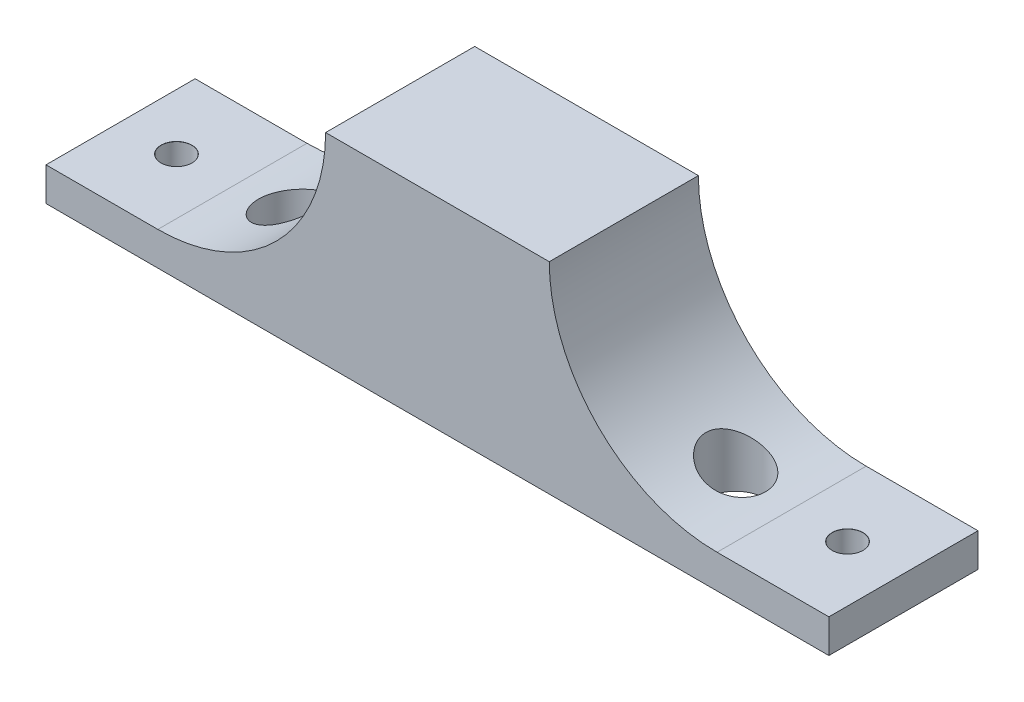
ISO-10303-21;
HEADER;
FILE_DESCRIPTION(('STEP AP214'),'2;1');
FILE_NAME('part.step','',(''),(''),'','','');
FILE_SCHEMA(('AUTOMOTIVE_DESIGN { 1 0 10303 214 1 1 1 1 }'));
ENDSEC;
DATA;
#1=APPLICATION_CONTEXT('core data for automotive mechanical design processes');
#2=APPLICATION_PROTOCOL_DEFINITION('international standard','automotive_design',2000,#1);
#3=PRODUCT_CONTEXT('',#1,'mechanical');
#4=PRODUCT('Part','Part','',(#3));
#5=PRODUCT_RELATED_PRODUCT_CATEGORY('part','',(#4));
#6=PRODUCT_DEFINITION_FORMATION('','',#4);
#7=PRODUCT_DEFINITION_CONTEXT('part definition',#1,'design');
#8=PRODUCT_DEFINITION('design','',#6,#7);
#9=PRODUCT_DEFINITION_SHAPE('','',#8);
#10=(LENGTH_UNIT() NAMED_UNIT(*) SI_UNIT(.MILLI.,.METRE.));
#11=(NAMED_UNIT(*) PLANE_ANGLE_UNIT() SI_UNIT($,.RADIAN.));
#12=(NAMED_UNIT(*) SI_UNIT($,.STERADIAN.) SOLID_ANGLE_UNIT());
#13=UNCERTAINTY_MEASURE_WITH_UNIT(LENGTH_MEASURE(1.E-05),#10,'distance_accuracy_value','');
#14=(GEOMETRIC_REPRESENTATION_CONTEXT(3) GLOBAL_UNCERTAINTY_ASSIGNED_CONTEXT((#13)) GLOBAL_UNIT_ASSIGNED_CONTEXT((#10,
#11,#12)) REPRESENTATION_CONTEXT('',''));
#15=CARTESIAN_POINT('',(0.,0.,0.));
#16=DIRECTION('',(0.,0.,1.));
#17=DIRECTION('',(1.,0.,0.));
#18=AXIS2_PLACEMENT_3D('',#15,#16,#17);
#19=CARTESIAN_POINT('',(-60.,54.,40.));
#20=DIRECTION('',(0.,0.,-1.));
#21=DIRECTION('',(-1.,0.,0.));
#22=AXIS2_PLACEMENT_3D('',#19,#20,#21);
#23=PLANE('',#22);
#24=CARTESIAN_POINT('',(-105.,54.,40.));
#25=DIRECTION('',(0.,0.,-1.));
#26=DIRECTION('',(-1.,0.,0.));
#27=AXIS2_PLACEMENT_3D('',#24,#25,#26);
#28=CIRCLE('',#27,45.0000000000001);
#29=CARTESIAN_POINT('',(-59.9999999999999,54.,40.));
#30=VERTEX_POINT('',#29);
#31=CARTESIAN_POINT('',(-105.,9.,40.));
#32=VERTEX_POINT('',#31);
#33=EDGE_CURVE('E119',#30,#32,#28,.T.);
#34=ORIENTED_EDGE('',*,*,#33,.T.);
#35=DIRECTION('',(-1.,0.,0.));
#36=VECTOR('',#35,1.);
#37=CARTESIAN_POINT('',(-60.,9.,40.));
#38=LINE('',#37,#36);
#39=CARTESIAN_POINT('',(-135.,9.,40.));
#40=VERTEX_POINT('',#39);
#41=EDGE_CURVE('E109',#32,#40,#38,.T.);
#42=ORIENTED_EDGE('',*,*,#41,.T.);
#43=DIRECTION('',(0.,-1.,0.));
#44=VECTOR('',#43,1.);
#45=CARTESIAN_POINT('',(-135.,54.,40.));
#46=LINE('',#45,#44);
#47=CARTESIAN_POINT('',(-135.,0.,40.));
#48=VERTEX_POINT('',#47);
#49=EDGE_CURVE('E116',#40,#48,#46,.T.);
#50=ORIENTED_EDGE('',*,*,#49,.T.);
#51=DIRECTION('',(1.,0.,0.));
#52=VECTOR('',#51,1.);
#53=CARTESIAN_POINT('',(-60.,0.,40.));
#54=LINE('',#53,#52);
#55=CARTESIAN_POINT('',(75.,0.,40.));
#56=VERTEX_POINT('',#55);
#57=EDGE_CURVE('E185',#48,#56,#54,.T.);
#58=ORIENTED_EDGE('',*,*,#57,.T.);
#59=DIRECTION('',(0.,-1.,0.));
#60=VECTOR('',#59,1.);
#61=CARTESIAN_POINT('',(75.,54.,40.));
#62=LINE('',#61,#60);
#63=CARTESIAN_POINT('',(75.,8.99999999999994,40.));
#64=VERTEX_POINT('',#63);
#65=EDGE_CURVE('E182',#64,#56,#62,.T.);
#66=ORIENTED_EDGE('',*,*,#65,.F.);
#67=DIRECTION('',(1.,0.,0.));
#68=VECTOR('',#67,1.);
#69=CARTESIAN_POINT('',(0.,9.,40.));
#70=LINE('',#69,#68);
#71=CARTESIAN_POINT('',(45.,9.,40.));
#72=VERTEX_POINT('',#71);
#73=EDGE_CURVE('E66',#72,#64,#70,.T.);
#74=ORIENTED_EDGE('',*,*,#73,.F.);
#75=CARTESIAN_POINT('',(45.,54.,40.));
#76=DIRECTION('',(0.,0.,1.));
#77=DIRECTION('',(1.,0.,0.));
#78=AXIS2_PLACEMENT_3D('',#75,#76,#77);
#79=CIRCLE('',#78,45.0000000000001);
#80=CARTESIAN_POINT('',(0.,54.,40.));
#81=VERTEX_POINT('',#80);
#82=EDGE_CURVE('E149',#81,#72,#79,.T.);
#83=ORIENTED_EDGE('',*,*,#82,.F.);
#84=DIRECTION('',(1.,0.,0.));
#85=VECTOR('',#84,1.);
#86=CARTESIAN_POINT('',(-60.,54.,40.));
#87=LINE('',#86,#85);
#88=EDGE_CURVE('E186',#30,#81,#87,.T.);
#89=ORIENTED_EDGE('',*,*,#88,.F.);
#90=EDGE_LOOP('',(#34,#42,#50,#58,#66,#74,#83,#89));
#91=FACE_BOUND('',#90,.T.);
#92=ADVANCED_FACE('F44',(#91),#23,.F.);
#93=CARTESIAN_POINT('',(-60.,54.,0.));
#94=DIRECTION('',(0.,0.,1.));
#95=DIRECTION('',(1.,0.,0.));
#96=AXIS2_PLACEMENT_3D('',#93,#94,#95);
#97=PLANE('',#96);
#98=CARTESIAN_POINT('',(-105.,54.,0.));
#99=DIRECTION('',(0.,0.,1.));
#100=DIRECTION('',(1.,0.,0.));
#101=AXIS2_PLACEMENT_3D('',#98,#99,#100);
#102=CIRCLE('',#101,45.0000000000001);
#103=CARTESIAN_POINT('',(-59.9999999999999,54.,0.));
#104=VERTEX_POINT('',#103);
#105=CARTESIAN_POINT('',(-105.,9.,0.));
#106=VERTEX_POINT('',#105);
#107=EDGE_CURVE('E243',#104,#106,#102,.F.);
#108=ORIENTED_EDGE('',*,*,#107,.F.);
#109=DIRECTION('',(-1.,0.,0.));
#110=VECTOR('',#109,1.);
#111=CARTESIAN_POINT('',(-60.,54.,0.));
#112=LINE('',#111,#110);
#113=CARTESIAN_POINT('',(0.,54.,0.));
#114=VERTEX_POINT('',#113);
#115=EDGE_CURVE('E189',#114,#104,#112,.T.);
#116=ORIENTED_EDGE('',*,*,#115,.F.);
#117=CARTESIAN_POINT('',(45.,54.,0.));
#118=DIRECTION('',(0.,0.,1.));
#119=DIRECTION('',(1.,0.,0.));
#120=AXIS2_PLACEMENT_3D('',#117,#118,#119);
#121=CIRCLE('',#120,45.0000000000001);
#122=CARTESIAN_POINT('',(45.,9.,0.));
#123=VERTEX_POINT('',#122);
#124=EDGE_CURVE('E163',#114,#123,#121,.T.);
#125=ORIENTED_EDGE('',*,*,#124,.T.);
#126=DIRECTION('',(1.,0.,0.));
#127=VECTOR('',#126,1.);
#128=CARTESIAN_POINT('',(-60.,9.,0.));
#129=LINE('',#128,#127);
#130=CARTESIAN_POINT('',(75.,9.,0.));
#131=VERTEX_POINT('',#130);
#132=EDGE_CURVE('E167',#123,#131,#129,.T.);
#133=ORIENTED_EDGE('',*,*,#132,.T.);
#134=DIRECTION('',(0.,-1.,0.));
#135=VECTOR('',#134,1.);
#136=CARTESIAN_POINT('',(75.,54.,0.));
#137=LINE('',#136,#135);
#138=CARTESIAN_POINT('',(75.,0.,0.));
#139=VERTEX_POINT('',#138);
#140=EDGE_CURVE('E179',#131,#139,#137,.T.);
#141=ORIENTED_EDGE('',*,*,#140,.T.);
#142=DIRECTION('',(-1.,0.,0.));
#143=VECTOR('',#142,1.);
#144=CARTESIAN_POINT('',(-60.,0.,0.));
#145=LINE('',#144,#143);
#146=CARTESIAN_POINT('',(-135.,0.,0.));
#147=VERTEX_POINT('',#146);
#148=EDGE_CURVE('E190',#139,#147,#145,.T.);
#149=ORIENTED_EDGE('',*,*,#148,.T.);
#150=DIRECTION('',(0.,-1.,0.));
#151=VECTOR('',#150,1.);
#152=CARTESIAN_POINT('',(-135.,54.,0.));
#153=LINE('',#152,#151);
#154=CARTESIAN_POINT('',(-135.,9.,0.));
#155=VERTEX_POINT('',#154);
#156=EDGE_CURVE('E128',#155,#147,#153,.T.);
#157=ORIENTED_EDGE('',*,*,#156,.F.);
#158=DIRECTION('',(-1.,0.,0.));
#159=VECTOR('',#158,1.);
#160=CARTESIAN_POINT('',(-60.,9.,0.));
#161=LINE('',#160,#159);
#162=EDGE_CURVE('E59',#106,#155,#161,.T.);
#163=ORIENTED_EDGE('',*,*,#162,.F.);
#164=EDGE_LOOP('',(#108,#116,#125,#133,#141,#149,#157,#163));
#165=FACE_BOUND('',#164,.T.);
#166=ADVANCED_FACE('F262',(#165),#97,.F.);
#167=CARTESIAN_POINT('',(0.,54.,0.));
#168=DIRECTION('',(0.,1.,0.));
#169=DIRECTION('',(0.,0.,1.));
#170=AXIS2_PLACEMENT_3D('',#167,#168,#169);
#171=PLANE('',#170);
#172=ORIENTED_EDGE('',*,*,#115,.T.);
#173=DIRECTION('',(0.,0.,1.));
#174=VECTOR('',#173,1.);
#175=CARTESIAN_POINT('',(-59.9999999999999,54.,-20.));
#176=LINE('',#175,#174);
#177=EDGE_CURVE('E244',#104,#30,#176,.T.);
#178=ORIENTED_EDGE('',*,*,#177,.T.);
#179=ORIENTED_EDGE('',*,*,#88,.T.);
#180=DIRECTION('',(0.,0.,1.));
#181=VECTOR('',#180,1.);
#182=CARTESIAN_POINT('',(0.,54.,-20.));
#183=LINE('',#182,#181);
#184=EDGE_CURVE('E155',#114,#81,#183,.T.);
#185=ORIENTED_EDGE('',*,*,#184,.F.);
#186=EDGE_LOOP('',(#172,#178,#179,#185));
#187=FACE_BOUND('',#186,.T.);
#188=ADVANCED_FACE('F230',(#187),#171,.T.);
#189=CARTESIAN_POINT('',(-135.,54.,0.));
#190=DIRECTION('',(-1.,0.,0.));
#191=DIRECTION('',(0.,0.,1.));
#192=AXIS2_PLACEMENT_3D('',#189,#190,#191);
#193=PLANE('',#192);
#194=ORIENTED_EDGE('',*,*,#49,.F.);
#195=DIRECTION('',(0.,0.,-1.));
#196=VECTOR('',#195,1.);
#197=CARTESIAN_POINT('',(-135.,9.,0.));
#198=LINE('',#197,#196);
#199=EDGE_CURVE('E11',#40,#155,#198,.T.);
#200=ORIENTED_EDGE('',*,*,#199,.T.);
#201=ORIENTED_EDGE('',*,*,#156,.T.);
#202=DIRECTION('',(0.,0.,-1.));
#203=VECTOR('',#202,1.);
#204=CARTESIAN_POINT('',(-135.,0.,0.));
#205=LINE('',#204,#203);
#206=EDGE_CURVE('E126',#48,#147,#205,.T.);
#207=ORIENTED_EDGE('',*,*,#206,.F.);
#208=EDGE_LOOP('',(#194,#200,#201,#207));
#209=FACE_BOUND('',#208,.T.);
#210=ADVANCED_FACE('F124',(#209),#193,.T.);
#211=CARTESIAN_POINT('',(-90.,54.,20.));
#212=DIRECTION('',(0.,-1.,0.));
#213=DIRECTION('',(0.,0.,-1.));
#214=AXIS2_PLACEMENT_3D('',#211,#212,#213);
#215=CYLINDRICAL_SURFACE('',#214,7.99999999999999);
#216=CARTESIAN_POINT('',(-90.,0.,20.));
#217=DIRECTION('',(0.,-1.,0.));
#218=DIRECTION('',(0.,0.,1.));
#219=AXIS2_PLACEMENT_3D('',#216,#217,#218);
#220=CIRCLE('',#219,7.99999999999999);
#221=CARTESIAN_POINT('',(-90.,0.,28.));
#222=VERTEX_POINT('',#221);
#223=EDGE_CURVE('E134',#222,#222,#220,.T.);
#224=ORIENTED_EDGE('',*,*,#223,.T.);
#225=EDGE_LOOP('',(#224));
#226=FACE_BOUND('',#225,.T.);
#227=CARTESIAN_POINT('',(-90.,11.5735931288071,12.));
#228=CARTESIAN_POINT('',(-89.7577570618509,11.6592383935645,11.9999992374111));
#229=CARTESIAN_POINT('',(-89.5162716392658,11.7469564800232,12.0110068956321));
#230=CARTESIAN_POINT('',(-89.0364699803467,11.9258833616566,12.0545824409712));
#231=CARTESIAN_POINT('',(-88.7981548768108,12.0170933616702,12.0871578340842));
#232=CARTESIAN_POINT('',(-88.3261190197423,12.2023203836002,12.1733949253093));
#233=CARTESIAN_POINT('',(-88.0924044504068,12.2963408059741,12.227083209039));
#234=CARTESIAN_POINT('',(-87.6313760933478,12.4862284483265,12.3549419820975));
#235=CARTESIAN_POINT('',(-87.404064876868,12.5820963848616,12.4291205735999));
#236=CARTESIAN_POINT('',(-86.7349606055954,12.8706555891533,12.6811114326688));
#237=CARTESIAN_POINT('',(-86.3046194712931,13.0648464739197,12.8886342616367));
#238=CARTESIAN_POINT('',(-85.4860967777733,13.4486476778247,13.3779153231439));
#239=CARTESIAN_POINT('',(-85.0979118459494,13.638258362446,13.6596676109449));
#240=CARTESIAN_POINT('',(-84.5528804427681,13.9131210310118,14.1358412864759));
#241=CARTESIAN_POINT('',(-84.3762287179495,14.0037935574841,14.3049673099668));
#242=CARTESIAN_POINT('',(-84.0380122998404,14.1800135367719,14.6600796378772));
#243=CARTESIAN_POINT('',(-83.8764408487224,14.2655632790077,14.8460583158676));
#244=CARTESIAN_POINT('',(-83.5699144699415,14.4300400940248,15.2339615816602));
#245=CARTESIAN_POINT('',(-83.4249593777798,14.5089672323664,15.4358860115692));
#246=CARTESIAN_POINT('',(-83.1532979055126,14.6586012470639,15.8545317681028));
#247=CARTESIAN_POINT('',(-83.0265893749559,14.7293090919161,16.0712513465982));
#248=CARTESIAN_POINT('',(-82.8023715768673,14.8556450310969,16.5002864004388));
#249=CARTESIAN_POINT('',(-82.7033430567268,14.9120245402556,16.7115864483186));
#250=CARTESIAN_POINT('',(-82.5234829777382,15.0151703796477,17.1440396217046));
#251=CARTESIAN_POINT('',(-82.4426483010086,15.061938356891,17.3651910511849));
#252=CARTESIAN_POINT('',(-82.3004492296733,15.1446636014867,17.8153767096004));
#253=CARTESIAN_POINT('',(-82.2390639657149,15.1806324541856,18.044402195004));
#254=CARTESIAN_POINT('',(-82.1366822340487,15.2408430355262,18.5084695517448));
#255=CARTESIAN_POINT('',(-82.0956825209434,15.2650866308222,18.7435104591527));
#256=CARTESIAN_POINT('',(-82.0389432287602,15.2986978509173,19.1850296214009));
#257=CARTESIAN_POINT('',(-82.0205282101904,15.3096392542204,19.39104910725));
#258=CARTESIAN_POINT('',(-81.9997241856645,15.3220028060447,19.8041735879873));
#259=CARTESIAN_POINT('',(-81.9973336908703,15.3234258389175,20.011278480241));
#260=CARTESIAN_POINT('',(-82.0086111058309,15.316720968632,20.4248386529795));
#261=CARTESIAN_POINT('',(-82.022275006199,15.3085954501063,20.6312940827508));
#262=CARTESIAN_POINT('',(-82.0654575870984,15.2829831631618,21.0419500649001));
#263=CARTESIAN_POINT('',(-82.0949761390789,15.2654964706442,21.246150635547));
#264=CARTESIAN_POINT('',(-82.1671546197088,15.2229087456733,21.6382265271553));
#265=CARTESIAN_POINT('',(-82.2088910743859,15.1983442492763,21.82633160034));
#266=CARTESIAN_POINT('',(-82.3054921845725,15.1417647535515,22.1980533406678));
#267=CARTESIAN_POINT('',(-82.3603609983111,15.1097473944382,22.3816685658083));
#268=CARTESIAN_POINT('',(-82.4826215226396,15.0388314718008,22.7432530085171));
#269=CARTESIAN_POINT('',(-82.5500101968044,14.9999345768708,22.9212235828486));
#270=CARTESIAN_POINT('',(-82.6966923092573,14.9158649506796,23.270723854461));
#271=CARTESIAN_POINT('',(-82.7759902957456,14.8706898222374,23.4422510595783));
#272=CARTESIAN_POINT('',(-82.9511919813312,14.7716835688867,23.788711239896));
#273=CARTESIAN_POINT('',(-83.047830710813,14.717484804078,23.9631679486564));
#274=CARTESIAN_POINT('',(-83.2529495563527,14.6035587033419,24.3031116705712));
#275=CARTESIAN_POINT('',(-83.3614339524751,14.5438293703077,24.4685954090847));
#276=CARTESIAN_POINT('',(-83.7034237105825,14.3575598892364,24.9505714319011));
#277=CARTESIAN_POINT('',(-83.9535492883996,14.2238903628393,25.2527522732266));
#278=CARTESIAN_POINT('',(-84.5254437334195,13.926203970454,25.8498992340467));
#279=CARTESIAN_POINT('',(-84.8522714468148,13.7604865811308,26.1391316212824));
#280=CARTESIAN_POINT('',(-85.545850718085,13.4206339931867,26.6594597813635));
#281=CARTESIAN_POINT('',(-85.9126230535141,13.2464944401335,26.8905250891635));
#282=CARTESIAN_POINT('',(-86.5054899346477,12.9755319703403,27.200339497113));
#283=CARTESIAN_POINT('',(-86.7207020862084,12.8791446163192,27.3008648166605));
#284=CARTESIAN_POINT('',(-87.1593987110663,12.6869249808558,27.4824647738556));
#285=CARTESIAN_POINT('',(-87.3828806725773,12.5910925409323,27.5635452624025));
#286=CARTESIAN_POINT('',(-87.8368696705742,12.4008702948366,27.7056791210016));
#287=CARTESIAN_POINT('',(-88.0673805526723,12.3064813223962,27.7667213049136));
#288=CARTESIAN_POINT('',(-88.5337577050948,12.1201016459585,27.8681032503355));
#289=CARTESIAN_POINT('',(-88.7696217579355,12.0281099816452,27.9084514263407));
#290=CARTESIAN_POINT('',(-89.2487854892403,11.8459264913428,27.9683651000232));
#291=CARTESIAN_POINT('',(-89.4921436334599,11.7557823709958,27.9876097312299));
#292=CARTESIAN_POINT('',(-89.9809567020687,11.5795355183981,28.0037121890075));
#293=CARTESIAN_POINT('',(-90.2264107569458,11.4934311981172,28.0005788877473));
#294=CARTESIAN_POINT('',(-90.7175663487039,11.3258929794588,27.9715501899423));
#295=CARTESIAN_POINT('',(-90.9632678738175,11.2444588687737,27.9456558289902));
#296=CARTESIAN_POINT('',(-91.4528437591707,11.0868239553653,27.8708673217652));
#297=CARTESIAN_POINT('',(-91.6967182319091,11.0106228280273,27.8219746036159));
#298=CARTESIAN_POINT('',(-92.1674788251149,10.8678352354506,27.7043951875207));
#299=CARTESIAN_POINT('',(-92.3945752152877,10.8009524002764,27.6369089950712));
#300=CARTESIAN_POINT('',(-92.8432146912883,10.6725606070578,27.4814757366373));
#301=CARTESIAN_POINT('',(-93.0647581257882,10.6110513110011,27.3935299589005));
#302=CARTESIAN_POINT('',(-93.5002549511456,10.493601356089,27.1975838890262));
#303=CARTESIAN_POINT('',(-93.7142103716462,10.4376592007926,27.0895890085521));
#304=CARTESIAN_POINT('',(-94.1326003766211,10.3314047387817,26.8541393695276));
#305=CARTESIAN_POINT('',(-94.3370353967979,10.28109217428,26.7266855026654));
#306=CARTESIAN_POINT('',(-94.7225416542665,10.1889196302258,26.46134963411));
#307=CARTESIAN_POINT('',(-94.904278973834,10.1467340965855,26.3245471125365));
#308=CARTESIAN_POINT('',(-95.2560533826406,10.0672329152389,26.0353738583476));
#309=CARTESIAN_POINT('',(-95.4260909630508,10.0299170630375,25.8830037799476));
#310=CARTESIAN_POINT('',(-95.7529733969524,9.96001316109434,25.5637651980698));
#311=CARTESIAN_POINT('',(-95.9098200688778,9.92742445924039,25.3968986994663));
#312=CARTESIAN_POINT('',(-96.2089857311509,9.86677701263199,25.049849406105));
#313=CARTESIAN_POINT('',(-96.3513048951302,9.83871821373418,24.869666770545));
#314=CARTESIAN_POINT('',(-96.6160411163143,9.78770702915201,24.503058934221));
#315=CARTESIAN_POINT('',(-96.7389359850459,9.76462403329956,24.3169966780487));
#316=CARTESIAN_POINT('',(-96.9689281822666,9.72229043682644,23.9349400625351));
#317=CARTESIAN_POINT('',(-97.0760258262772,9.70303975965932,23.7389459016713));
#318=CARTESIAN_POINT('',(-97.2735614060125,9.66815803422709,23.3384368252235));
#319=CARTESIAN_POINT('',(-97.3640000523898,9.65252683155228,23.1339222735656));
#320=CARTESIAN_POINT('',(-97.5275048153169,9.62468367871782,22.7178366735429));
#321=CARTESIAN_POINT('',(-97.6005709108684,9.61247173269107,22.5062656166491));
#322=CARTESIAN_POINT('',(-97.728246055097,9.59137751405729,22.0792958043269));
#323=CARTESIAN_POINT('',(-97.7829967321115,9.58246963070146,21.8639406485169));
#324=CARTESIAN_POINT('',(-97.874426890289,9.56771043216851,21.4292470950362));
#325=CARTESIAN_POINT('',(-97.9111001620493,9.56186016721033,21.2099073554881));
#326=CARTESIAN_POINT('',(-97.9660609403891,9.55312747552906,20.7689194001448));
#327=CARTESIAN_POINT('',(-97.9843518496063,9.55024449954837,20.5472716192532));
#328=CARTESIAN_POINT('',(-98.0024204183065,9.54739642859867,20.1031993285317));
#329=CARTESIAN_POINT('',(-98.0021976877091,9.5474313951104,19.8807748024346));
#330=CARTESIAN_POINT('',(-97.9832427407797,9.55041947441562,19.4368072081152));
#331=CARTESIAN_POINT('',(-97.9645164741015,9.55337164920573,19.2152638795412));
#332=CARTESIAN_POINT('',(-97.9087062639187,9.56224184679164,18.7745620212332));
#333=CARTESIAN_POINT('',(-97.8716223511918,9.56815986461502,18.5554034875017));
#334=CARTESIAN_POINT('',(-97.779380606198,9.5830568903703,18.1210281849582));
#335=CARTESIAN_POINT('',(-97.7242226764183,9.59203591481694,17.9058114374196));
#336=CARTESIAN_POINT('',(-97.5962591727146,9.61319088951524,17.4808561541774));
#337=CARTESIAN_POINT('',(-97.5234539787406,9.62536677093826,17.2711175006368));
#338=CARTESIAN_POINT('',(-97.360748029962,9.65308764353384,16.8585732600525));
#339=CARTESIAN_POINT('',(-97.2708447261117,9.66863313710827,16.6557687120948));
#340=CARTESIAN_POINT('',(-97.0746893164172,9.70328048166552,16.2586365322476));
#341=CARTESIAN_POINT('',(-96.9684432208246,9.72238102577731,16.0643058175931));
#342=CARTESIAN_POINT('',(-96.7404031343327,9.76435266391911,15.6853892419042));
#343=CARTESIAN_POINT('',(-96.6186073391794,9.78722419559213,15.5008045152297));
#344=CARTESIAN_POINT('',(-96.3604463399598,9.83694547538946,15.1426915653555));
#345=CARTESIAN_POINT('',(-96.2240811459411,9.86379522077027,14.969163334531));
#346=CARTESIAN_POINT('',(-95.9377761562221,9.92168973158692,14.6342397711251));
#347=CARTESIAN_POINT('',(-95.7878273163836,9.95273729885369,14.4728526550572));
#348=CARTESIAN_POINT('',(-95.475637469473,10.0191862245472,14.163417278729));
#349=CARTESIAN_POINT('',(-95.3133964459033,10.0545875888172,14.0153690363714));
#350=CARTESIAN_POINT('',(-94.9778917542574,10.1298859976691,13.733533576725));
#351=CARTESIAN_POINT('',(-94.8046260358277,10.1697838795757,13.5997490246237));
#352=CARTESIAN_POINT('',(-94.4484801882035,10.2541554722688,13.3472809989));
#353=CARTESIAN_POINT('',(-94.2656001132898,10.2986291572225,13.2285974400335));
#354=CARTESIAN_POINT('',(-93.8897377361948,10.3926614302701,13.0058488288798));
#355=CARTESIAN_POINT('',(-93.6966710163055,10.4422675211081,12.9019463102716));
#356=CARTESIAN_POINT('',(-93.3036937816636,10.5461425579154,12.7107366119752));
#357=CARTESIAN_POINT('',(-93.1037830170874,10.6004116742053,12.6234300388417));
#358=CARTESIAN_POINT('',(-92.6987979342993,10.7134596105529,12.4658337495596));
#359=CARTESIAN_POINT('',(-92.4937278355979,10.772234821044,12.3955305967216));
#360=CARTESIAN_POINT('',(-92.0798277080032,10.8941337118559,12.2720661446412));
#361=CARTESIAN_POINT('',(-91.8709984436734,10.9572565151539,12.2189014003555));
#362=CARTESIAN_POINT('',(-91.3861501617149,11.1077421881747,12.1159988406931));
#363=CARTESIAN_POINT('',(-91.1092712212717,11.1965771615757,12.0723741418266));
#364=CARTESIAN_POINT('',(-90.5545984767424,11.3805703953558,12.0143754789649));
#365=CARTESIAN_POINT('',(-90.27680469292,11.4757285165613,12.0000008713905));
#366=CARTESIAN_POINT('',(-90.,11.5735931288071,12.));
#367=B_SPLINE_CURVE_WITH_KNOTS('',3,(#227,#228,#229,#230,#231,#232,#233,#234,#235,#236,#237,
#238,#239,#240,#241,#242,#243,#244,#245,#246,#247,#248,#249,#250,#251,#252,#253,#254,#255,#256,
#257,#258,#259,#260,#261,#262,#263,#264,#265,#266,#267,#268,#269,#270,#271,#272,#273,#274,#275,
#276,#277,#278,#279,#280,#281,#282,#283,#284,#285,#286,#287,#288,#289,#290,#291,#292,#293,#294,
#295,#296,#297,#298,#299,#300,#301,#302,#303,#304,#305,#306,#307,#308,#309,#310,#311,#312,#313,
#314,#315,#316,#317,#318,#319,#320,#321,#322,#323,#324,#325,#326,#327,#328,#329,#330,#331,#332,
#333,#334,#335,#336,#337,#338,#339,#340,#341,#342,#343,#344,#345,#346,#347,#348,#349,#350,#351,
#352,#353,#354,#355,#356,#357,#358,#359,#360,#361,#362,#363,#364,#365,#366),.UNSPECIFIED.,.T.,
.F.,(4,2,2,2,2,2,2,2,2,2,2,2,2,2,2,2,2,2,2,2,2,2,2,2,2,2,2,2,2,2,2,2,2,2,2,2,2,2,2,2,2,2,2,2,2,
2,2,2,2,2,2,2,2,2,2,2,2,2,2,2,2,2,2,2,2,2,2,2,2,4),(0.,0.770534715521514,1.54133773330312,
2.31311447998987,3.08519683665132,4.62490853868461,6.1644969688768,6.94612105324105,
7.72739317453298,8.50865756071098,9.28982979537502,10.0090072871934,10.7280614394697,
11.4463414081217,12.1645069893312,12.7850838803087,13.4056031127033,14.0259674110257,
14.646326679459,15.2283995374096,15.8106569472593,16.3927733269048,16.9751125864351,
17.594458648929,18.2140292380972,19.4526061790289,20.8476482634913,22.2434194890504,
23.0117131598221,23.7797753621552,24.5482655996333,25.3164431091785,26.0961449563752,
26.8755376926959,27.6548949697042,28.4342038575382,29.1717703869845,29.9092904877621,
30.6466118054412,31.3838993462623,32.0770942911185,32.770260116925,33.4633302291237,
34.1563920568348,34.8281177677169,35.499830060253,36.1715136917203,36.843198135058,
37.5095616068262,38.1761538083724,38.842622598707,39.5091054314701,40.1753740320868,
40.8416415156658,41.5079125939467,42.1741693285232,42.84052546895,43.5066371324936,
44.1728261562998,44.8390147206846,45.5056501472421,46.1722864685134,46.8390471340821,
47.5058040356608,48.1794039847256,48.8530285480383,49.5261190378411,50.1990741431959,
51.0795634568935,51.9600333972919),.UNSPECIFIED.);
#368=CARTESIAN_POINT('',(-90.,11.5735931288071,12.));
#369=VERTEX_POINT('',#368);
#370=EDGE_CURVE('E237',#369,#369,#367,.T.);
#371=ORIENTED_EDGE('',*,*,#370,.F.);
#372=EDGE_LOOP('',(#371));
#373=FACE_BOUND('',#372,.T.);
#374=ADVANCED_FACE('F229',(#226,#373),#215,.F.);
#375=CARTESIAN_POINT('',(0.,0.,0.));
#376=DIRECTION('',(0.,1.,0.));
#377=DIRECTION('',(0.,0.,1.));
#378=AXIS2_PLACEMENT_3D('',#375,#376,#377);
#379=PLANE('',#378);
#380=CARTESIAN_POINT('',(-120.,0.,20.));
#381=DIRECTION('',(0.,1.,0.));
#382=DIRECTION('',(0.,0.,1.));
#383=AXIS2_PLACEMENT_3D('',#380,#381,#382);
#384=CIRCLE('',#383,4.125);
#385=CARTESIAN_POINT('',(-120.,0.,24.125));
#386=VERTEX_POINT('',#385);
#387=EDGE_CURVE('E121',#386,#386,#384,.T.);
#388=ORIENTED_EDGE('',*,*,#387,.T.);
#389=EDGE_LOOP('',(#388));
#390=FACE_BOUND('',#389,.T.);
#391=CARTESIAN_POINT('',(60.,0.,20.));
#392=DIRECTION('',(0.,1.,0.));
#393=DIRECTION('',(0.,0.,1.));
#394=AXIS2_PLACEMENT_3D('',#391,#392,#393);
#395=CIRCLE('',#394,4.125);
#396=CARTESIAN_POINT('',(60.,0.,24.125));
#397=VERTEX_POINT('',#396);
#398=EDGE_CURVE('E145',#397,#397,#395,.T.);
#399=ORIENTED_EDGE('',*,*,#398,.T.);
#400=EDGE_LOOP('',(#399));
#401=FACE_BOUND('',#400,.T.);
#402=ORIENTED_EDGE('',*,*,#57,.F.);
#403=ORIENTED_EDGE('',*,*,#206,.T.);
#404=ORIENTED_EDGE('',*,*,#148,.F.);
#405=DIRECTION('',(0.,0.,-1.));
#406=VECTOR('',#405,1.);
#407=CARTESIAN_POINT('',(75.,0.,0.));
#408=LINE('',#407,#406);
#409=EDGE_CURVE('E175',#56,#139,#408,.T.);
#410=ORIENTED_EDGE('',*,*,#409,.F.);
#411=EDGE_LOOP('',(#402,#403,#404,#410));
#412=FACE_BOUND('',#411,.T.);
#413=CARTESIAN_POINT('',(30.,0.,20.));
#414=DIRECTION('',(0.,1.,0.));
#415=DIRECTION('',(0.,0.,1.));
#416=AXIS2_PLACEMENT_3D('',#413,#414,#415);
#417=CIRCLE('',#416,7.99999999999999);
#418=CARTESIAN_POINT('',(30.,0.,28.));
#419=VERTEX_POINT('',#418);
#420=EDGE_CURVE('E171',#419,#419,#417,.T.);
#421=ORIENTED_EDGE('',*,*,#420,.T.);
#422=EDGE_LOOP('',(#421));
#423=FACE_BOUND('',#422,.T.);
#424=ORIENTED_EDGE('',*,*,#223,.F.);
#425=EDGE_LOOP('',(#424));
#426=FACE_BOUND('',#425,.T.);
#427=ADVANCED_FACE('F234',(#390,#401,#412,#423,#426),#379,.F.);
#428=CARTESIAN_POINT('',(75.,54.,0.));
#429=DIRECTION('',(-1.,0.,0.));
#430=DIRECTION('',(0.,0.,1.));
#431=AXIS2_PLACEMENT_3D('',#428,#429,#430);
#432=PLANE('',#431);
#433=ORIENTED_EDGE('',*,*,#140,.F.);
#434=DIRECTION('',(0.,0.,1.));
#435=VECTOR('',#434,1.);
#436=CARTESIAN_POINT('',(75.,9.,0.));
#437=LINE('',#436,#435);
#438=EDGE_CURVE('E52',#131,#64,#437,.T.);
#439=ORIENTED_EDGE('',*,*,#438,.T.);
#440=ORIENTED_EDGE('',*,*,#65,.T.);
#441=ORIENTED_EDGE('',*,*,#409,.T.);
#442=EDGE_LOOP('',(#433,#439,#440,#441));
#443=FACE_BOUND('',#442,.T.);
#444=ADVANCED_FACE('F275',(#443),#432,.F.);
#445=CARTESIAN_POINT('',(30.,54.,20.));
#446=DIRECTION('',(0.,-1.,0.));
#447=DIRECTION('',(0.,0.,-1.));
#448=AXIS2_PLACEMENT_3D('',#445,#446,#447);
#449=CYLINDRICAL_SURFACE('',#448,7.99999999999999);
#450=CARTESIAN_POINT('',(30.,11.5735931288071,12.));
#451=CARTESIAN_POINT('',(30.2236619417778,11.4945124667654,11.9999931502274));
#452=CARTESIAN_POINT('',(30.4478786708649,11.4172361690048,12.0093781625126));
#453=CARTESIAN_POINT('',(30.8960391328714,11.2667105160479,12.0471628347575));
#454=CARTESIAN_POINT('',(31.1199829289017,11.1934599190554,12.0755565951141));
#455=CARTESIAN_POINT('',(31.5661649592869,11.0513450027469,12.1515359494881));
#456=CARTESIAN_POINT('',(31.7884019567833,10.9824836408132,12.1991343281819));
#457=CARTESIAN_POINT('',(32.229255640574,10.8495531519209,12.3135021955709));
#458=CARTESIAN_POINT('',(32.4478737623524,10.7854820875394,12.3802638802694));
#459=CARTESIAN_POINT('',(32.8803258009938,10.6622085065028,12.532977366265));
#460=CARTESIAN_POINT('',(33.0941476173597,10.6030174732221,12.6189727569895));
#461=CARTESIAN_POINT('',(33.5146956496131,10.4898263962758,12.8097132778055));
#462=CARTESIAN_POINT('',(33.7214217812612,10.4358264142241,12.9144586304034));
#463=CARTESIAN_POINT('',(34.1259458640293,10.3330960963257,13.1421263986815));
#464=CARTESIAN_POINT('',(34.3237451571591,10.2843649668421,13.2650460701778));
#465=CARTESIAN_POINT('',(34.708678834655,10.1921481491122,13.5283148103323));
#466=CARTESIAN_POINT('',(34.8958135872255,10.1486622797098,13.6686632767104));
#467=CARTESIAN_POINT('',(35.250783421905,10.0684097722912,13.9601343057795));
#468=CARTESIAN_POINT('',(35.4190832576632,10.0314495204689,14.1106379874793));
#469=CARTESIAN_POINT('',(35.7428280582573,9.96215062850014,14.4258662204148));
#470=CARTESIAN_POINT('',(35.8982731860378,9.92981192976764,14.5905905913371));
#471=CARTESIAN_POINT('',(36.1949737510571,9.86957472155557,14.9330847421192));
#472=CARTESIAN_POINT('',(36.3362305070289,9.8416757992815,15.1108533069286));
#473=CARTESIAN_POINT('',(36.6033741987612,9.79010076940333,15.4781621506374));
#474=CARTESIAN_POINT('',(36.7292612917551,9.76642461859862,15.6677023090822));
#475=CARTESIAN_POINT('',(36.9618412125295,9.72357668039763,16.052579060571));
#476=CARTESIAN_POINT('',(37.0689152807982,9.70431219316109,16.2476750999096));
#477=CARTESIAN_POINT('',(37.2665791251754,9.66937532287615,16.6464400050716));
#478=CARTESIAN_POINT('',(37.3571632781524,9.65370416469717,16.8501117662097));
#479=CARTESIAN_POINT('',(37.521067755904,9.62576775067913,17.2644620555782));
#480=CARTESIAN_POINT('',(37.5943917619463,9.6135017684792,17.4751390787574));
#481=CARTESIAN_POINT('',(37.7232276326059,9.59219830315017,17.902033206127));
#482=CARTESIAN_POINT('',(37.7787392746284,9.58316086036677,18.1182503795142));
#483=CARTESIAN_POINT('',(37.8712969700539,9.56821202447971,18.5536320361216));
#484=CARTESIAN_POINT('',(37.9084294685615,9.56228598891332,18.7727776451122));
#485=CARTESIAN_POINT('',(37.964338677,9.55339975861222,19.2134618434916));
#486=CARTESIAN_POINT('',(37.9831150489156,9.55043961849243,19.4350004768704));
#487=CARTESIAN_POINT('',(38.0021652941327,9.54743648557175,19.878841846985));
#488=CARTESIAN_POINT('',(38.0024432946156,9.54739284206975,20.1011444022128));
#489=CARTESIAN_POINT('',(37.9845012740015,9.55022092741773,20.5450779811699));
#490=CARTESIAN_POINT('',(37.9662733875385,9.55309389588512,20.7667086791748));
#491=CARTESIAN_POINT('',(37.9114450703447,9.56180519262926,21.2076409789086));
#492=CARTESIAN_POINT('',(37.8748434924421,9.56764370606172,21.4269424343368));
#493=CARTESIAN_POINT('',(37.7835671058396,9.58237703992665,21.8615492479805));
#494=CARTESIAN_POINT('',(37.7288999966204,9.59127055838782,22.0768562673978));
#495=CARTESIAN_POINT('',(37.6018959973094,9.6122517293385,22.502084024266));
#496=CARTESIAN_POINT('',(37.5295554037616,9.62434005133845,22.7120036225884));
#497=CARTESIAN_POINT('',(37.3677733935175,9.6518789057844,23.1249129183426));
#498=CARTESIAN_POINT('',(37.2783323598036,9.66732936293289,23.3279027708534));
#499=CARTESIAN_POINT('',(37.0830629821217,9.7017841225424,23.7254881749357));
#500=CARTESIAN_POINT('',(36.9772371286161,9.72078788499857,23.9200849964945));
#501=CARTESIAN_POINT('',(36.7500245329098,9.76255838826882,24.2995431749019));
#502=CARTESIAN_POINT('',(36.6286379819082,9.7853250828476,24.4844046513323));
#503=CARTESIAN_POINT('',(36.3712503606021,9.83483443344651,24.8431300220502));
#504=CARTESIAN_POINT('',(36.2352472758175,9.86157763771254,25.0169923951598));
#505=CARTESIAN_POINT('',(35.9497771525315,9.91922578131158,25.3524424826923));
#506=CARTESIAN_POINT('',(35.8003146913871,9.9501293075302,25.5140343359547));
#507=CARTESIAN_POINT('',(35.488766426992,10.0163457449865,25.8242480605906));
#508=CARTESIAN_POINT('',(35.3266554406589,10.0516675418253,25.9728427400552));
#509=CARTESIAN_POINT('',(34.9913816427809,10.1268069888915,26.255734885522));
#510=CARTESIAN_POINT('',(34.8182188489941,10.1666246318951,26.3900323744962));
#511=CARTESIAN_POINT('',(34.4622243490803,10.2508430564984,26.6435156478446));
#512=CARTESIAN_POINT('',(34.2793927528243,10.2952437860238,26.762701603886));
#513=CARTESIAN_POINT('',(33.9054927423434,10.3886593065668,26.9853036852894));
#514=CARTESIAN_POINT('',(33.7144241131225,10.4376742180594,27.0887193987098));
#515=CARTESIAN_POINT('',(33.32275526153,10.5410130079489,27.2806270000626));
#516=CARTESIAN_POINT('',(33.1220581216634,10.5954024819316,27.3688856989605));
#517=CARTESIAN_POINT('',(32.7152474785412,10.7087833207133,27.5282906552984));
#518=CARTESIAN_POINT('',(32.5091339445987,10.7677747115886,27.5994368157628));
#519=CARTESIAN_POINT('',(32.0930238842162,10.8901752022798,27.7244055004271));
#520=CARTESIAN_POINT('',(31.883027578354,10.9535840517058,27.7782290055375));
#521=CARTESIAN_POINT('',(31.4605481351998,11.0845927692208,27.8685119157092));
#522=CARTESIAN_POINT('',(31.2480641405046,11.1521941189801,27.9049651419677));
#523=CARTESIAN_POINT('',(30.8137391574941,11.2939793075858,27.9616361927006));
#524=CARTESIAN_POINT('',(30.5918580444604,11.3683173287744,27.9811611609608));
#525=CARTESIAN_POINT('',(30.1484536417906,11.5207512945598,28.001702744525));
#526=CARTESIAN_POINT('',(29.9269305142454,11.5988486145909,28.0027125331783));
#527=CARTESIAN_POINT('',(29.4857490675357,11.7582790945604,27.9865042940167));
#528=CARTESIAN_POINT('',(29.2660905075021,11.8396118285776,27.9692886578691));
#529=CARTESIAN_POINT('',(28.8298984533515,12.0049719480327,27.9170180874135));
#530=CARTESIAN_POINT('',(28.6133661985256,12.0890003617175,27.8819562681463));
#531=CARTESIAN_POINT('',(27.9442166610886,12.3546078979502,27.7452544310972));
#532=CARTESIAN_POINT('',(27.4989840121461,12.5399723517665,27.6130371247046));
#533=CARTESIAN_POINT('',(26.638869394428,12.9136380118684,27.2743816394615));
#534=CARTESIAN_POINT('',(26.2239996383961,13.1019403633086,27.0679137904375));
#535=CARTESIAN_POINT('',(25.6228877727594,13.3849778825191,26.7007141386541));
#536=CARTESIAN_POINT('',(25.4218631967996,13.4815631746685,26.5650332150973));
#537=CARTESIAN_POINT('',(25.0322216610912,13.6721592631199,26.2753524543782));
#538=CARTESIAN_POINT('',(24.8435998405011,13.7661710594829,26.1213598611158));
#539=CARTESIAN_POINT('',(24.4800381491519,13.9503712805489,25.795657144168));
#540=CARTESIAN_POINT('',(24.305107642554,14.0405570694805,25.6239350774121));
#541=CARTESIAN_POINT('',(23.9706320856854,14.2155647655392,25.2637515964637));
#542=CARTESIAN_POINT('',(23.8110791603281,14.3003894104431,25.0752988463244));
#543=CARTESIAN_POINT('',(23.5133877987113,14.4607381505061,24.6884564591933));
#544=CARTESIAN_POINT('',(23.3747496425275,14.5364652337966,24.4905361228755));
#545=CARTESIAN_POINT('',(23.1149127131756,14.6799672023909,24.0809734738163));
#546=CARTESIAN_POINT('',(22.9937046179697,14.7477463348529,23.8693385844874));
#547=CARTESIAN_POINT('',(22.7702694430537,14.873850969546,23.4337816735069));
#548=CARTESIAN_POINT('',(22.6680282770722,14.9321834834244,23.209868931737));
#549=CARTESIAN_POINT('',(22.4839440818605,15.0379862161581,22.7513453053848));
#550=CARTESIAN_POINT('',(22.4020974536497,15.0854583513999,22.5167363170027));
#551=CARTESIAN_POINT('',(22.2689352672906,15.1631118927787,22.0684248112302));
#552=CARTESIAN_POINT('',(22.2150991577316,15.1947037349362,21.8557126030078));
#553=CARTESIAN_POINT('',(22.124938186456,15.2477833452568,21.4253801454448));
#554=CARTESIAN_POINT('',(22.0886108437952,15.269272544926,21.2077605960383));
#555=CARTESIAN_POINT('',(22.034048591505,15.3016010057475,20.7696257116611));
#556=CARTESIAN_POINT('',(22.015801719663,15.3124473082962,20.5491123892373));
#557=CARTESIAN_POINT('',(21.9976594716821,15.3232311447396,20.1070712141117));
#558=CARTESIAN_POINT('',(21.9977626573109,15.3231695335697,19.8855434422808));
#559=CARTESIAN_POINT('',(22.015275621454,15.3127602668336,19.4681917983308));
#560=CARTESIAN_POINT('',(22.0307555263267,15.3035596207933,19.2722545345609));
#561=CARTESIAN_POINT('',(22.0759908732234,15.2767447327879,18.8826194556396));
#562=CARTESIAN_POINT('',(22.1057460129734,15.2591306689745,18.6889215931585));
#563=CARTESIAN_POINT('',(22.1791609455821,15.2158393844827,18.305109228922));
#564=CARTESIAN_POINT('',(22.2228204413122,15.1901623361061,18.1149946506856));
#565=CARTESIAN_POINT('',(22.3235319943204,15.131231065316,17.7395527857338));
#566=CARTESIAN_POINT('',(22.3805845715023,15.0979765487554,17.5542256851728));
#567=CARTESIAN_POINT('',(22.5079783027605,15.0241816688856,17.1879734225342));
#568=CARTESIAN_POINT('',(22.578421823543,14.9835853056503,17.0070951640615));
#569=CARTESIAN_POINT('',(22.7315958176644,14.8959597752019,16.6522094224096));
#570=CARTESIAN_POINT('',(22.8143303515442,14.84892848251,16.4782042340039));
#571=CARTESIAN_POINT('',(23.0798658077687,14.6992496062661,15.967800046733));
#572=CARTESIAN_POINT('',(23.2800785471129,14.5879700170565,15.6427853967163));
#573=CARTESIAN_POINT('',(23.7445971014614,14.3353444618224,14.9954483805023));
#574=CARTESIAN_POINT('',(24.0134903776381,14.1920490925944,14.6772101670341));
#575=CARTESIAN_POINT('',(24.5933607989423,13.8916995528918,14.0890834094492));
#576=CARTESIAN_POINT('',(24.9043663127501,13.7346361330138,13.8192277452523));
#577=CARTESIAN_POINT('',(25.6019910296388,13.3935260086335,13.3015920615014));
#578=CARTESIAN_POINT('',(25.9932054821817,13.2085369837638,13.0606131122922));
#579=CARTESIAN_POINT('',(26.8105005721947,12.8375996730248,12.6490631145166));
#580=CARTESIAN_POINT('',(27.2365711699059,12.6516516777293,12.4784718768498));
#581=CARTESIAN_POINT('',(28.0488739867339,12.3127868525125,12.2317434389562));
#582=CARTESIAN_POINT('',(28.4316933272413,12.1590483771429,12.145375771941));
#583=CARTESIAN_POINT('',(29.2090954518418,11.8595164762411,12.0295137235595));
#584=CARTESIAN_POINT('',(29.6036767393381,11.7137220465234,12.0000121376225));
#585=CARTESIAN_POINT('',(30.,11.5735931288071,12.));
#586=B_SPLINE_CURVE_WITH_KNOTS('',3,(#450,#451,#452,#453,#454,#455,#456,#457,#458,#459,#460,
#461,#462,#463,#464,#465,#466,#467,#468,#469,#470,#471,#472,#473,#474,#475,#476,#477,#478,#479,
#480,#481,#482,#483,#484,#485,#486,#487,#488,#489,#490,#491,#492,#493,#494,#495,#496,#497,#498,
#499,#500,#501,#502,#503,#504,#505,#506,#507,#508,#509,#510,#511,#512,#513,#514,#515,#516,#517,
#518,#519,#520,#521,#522,#523,#524,#525,#526,#527,#528,#529,#530,#531,#532,#533,#534,#535,#536,
#537,#538,#539,#540,#541,#542,#543,#544,#545,#546,#547,#548,#549,#550,#551,#552,#553,#554,#555,
#556,#557,#558,#559,#560,#561,#562,#563,#564,#565,#566,#567,#568,#569,#570,#571,#572,#573,#574,
#575,#576,#577,#578,#579,#580,#581,#582,#583,#584,#585),.UNSPECIFIED.,.T.,.F.,(4,2,2,2,2,2,2,2,
2,2,2,2,2,2,2,2,2,2,2,2,2,2,2,2,2,2,2,2,2,2,2,2,2,2,2,2,2,2,2,2,2,2,2,2,2,2,2,2,2,2,2,2,2,2,2,2,
2,2,2,2,2,2,2,2,2,2,2,4),(0.,0.711356454780661,1.42249223346741,2.13410220440505,
2.84542279197031,3.55837208390453,4.27132983699078,4.98418004860459,5.69700563338473,
6.38251816568146,7.06802200718591,7.75346207571646,8.43889513152414,9.10823617983749,
9.77780505048439,10.447230984916,11.1166652845924,11.782920292314,12.4491875684352,
13.1153061928155,13.7817080492778,14.448151518085,15.1143113160123,15.7806108267806,
16.4468954168126,17.1130788320569,17.7792540624867,18.4455212245573,19.1115626475314,
19.7789657594681,20.4463677990442,21.1137622562526,21.7811741437915,22.4580788963746,
23.1349874848335,23.8118577359997,24.4889685780975,25.192636810147,25.896564483412,
26.6003997938348,27.3045068460923,28.7977276748943,30.2915458520524,31.0739048191525,
31.8559553166502,32.6385361057003,33.4207139699958,34.179368120746,34.9376150028642,
35.6952964793222,36.4528441545114,37.1169586844876,37.7809790835712,38.4445598664809,
39.1080886395907,39.6976758536824,40.2872505839851,40.876812716238,41.4663977383946,
42.0606856006018,42.6551702341191,43.8434115466437,45.1600222843529,46.4775244035892,
47.9571257426378,49.43630239647,50.6969676337285,51.9574731422233),.UNSPECIFIED.);
#587=CARTESIAN_POINT('',(30.,11.5735931288071,12.));
#588=VERTEX_POINT('',#587);
#589=EDGE_CURVE('E159',#588,#588,#586,.T.);
#590=ORIENTED_EDGE('',*,*,#589,.F.);
#591=EDGE_LOOP('',(#590));
#592=FACE_BOUND('',#591,.T.);
#593=ORIENTED_EDGE('',*,*,#420,.F.);
#594=EDGE_LOOP('',(#593));
#595=FACE_BOUND('',#594,.T.);
#596=ADVANCED_FACE('F207',(#592,#595),#449,.F.);
#597=CARTESIAN_POINT('',(0.,9.,-20.));
#598=DIRECTION('',(0.,-1.,0.));
#599=DIRECTION('',(0.,0.,-1.));
#600=AXIS2_PLACEMENT_3D('',#597,#598,#599);
#601=PLANE('',#600);
#602=CARTESIAN_POINT('',(60.,9.,20.));
#603=DIRECTION('',(0.,1.,0.));
#604=DIRECTION('',(0.,0.,1.));
#605=AXIS2_PLACEMENT_3D('',#602,#603,#604);
#606=CIRCLE('',#605,4.15);
#607=CARTESIAN_POINT('',(60.,9.,24.15));
#608=VERTEX_POINT('',#607);
#609=EDGE_CURVE('E132',#608,#608,#606,.T.);
#610=ORIENTED_EDGE('',*,*,#609,.F.);
#611=EDGE_LOOP('',(#610));
#612=FACE_BOUND('',#611,.T.);
#613=DIRECTION('',(0.,0.,1.));
#614=VECTOR('',#613,1.);
#615=CARTESIAN_POINT('',(45.,9.,-20.));
#616=LINE('',#615,#614);
#617=EDGE_CURVE('E156',#123,#72,#616,.T.);
#618=ORIENTED_EDGE('',*,*,#617,.T.);
#619=ORIENTED_EDGE('',*,*,#73,.T.);
#620=ORIENTED_EDGE('',*,*,#438,.F.);
#621=ORIENTED_EDGE('',*,*,#132,.F.);
#622=EDGE_LOOP('',(#618,#619,#620,#621));
#623=FACE_BOUND('',#622,.T.);
#624=ADVANCED_FACE('F215',(#612,#623),#601,.F.);
#625=CARTESIAN_POINT('',(45.,54.,-20.));
#626=DIRECTION('',(0.,0.,1.));
#627=DIRECTION('',(1.,0.,0.));
#628=AXIS2_PLACEMENT_3D('',#625,#626,#627);
#629=CYLINDRICAL_SURFACE('',#628,45.0000000000001);
#630=ORIENTED_EDGE('',*,*,#589,.T.);
#631=EDGE_LOOP('',(#630));
#632=FACE_BOUND('',#631,.T.);
#633=ORIENTED_EDGE('',*,*,#184,.T.);
#634=ORIENTED_EDGE('',*,*,#82,.T.);
#635=ORIENTED_EDGE('',*,*,#617,.F.);
#636=ORIENTED_EDGE('',*,*,#124,.F.);
#637=EDGE_LOOP('',(#633,#634,#635,#636));
#638=FACE_BOUND('',#637,.T.);
#639=ADVANCED_FACE('F210',(#632,#638),#629,.F.);
#640=CARTESIAN_POINT('',(60.,9.,20.));
#641=DIRECTION('',(0.,1.,0.));
#642=DIRECTION('',(0.,0.,1.));
#643=AXIS2_PLACEMENT_3D('',#640,#641,#642);
#644=CYLINDRICAL_SURFACE('',#643,4.125);
#645=ORIENTED_EDGE('',*,*,#398,.F.);
#646=EDGE_LOOP('',(#645));
#647=FACE_BOUND('',#646,.T.);
#648=CARTESIAN_POINT('',(60.,8.975,20.));
#649=DIRECTION('',(0.,1.,0.));
#650=DIRECTION('',(0.,0.,1.));
#651=AXIS2_PLACEMENT_3D('',#648,#649,#650);
#652=CIRCLE('',#651,4.125);
#653=CARTESIAN_POINT('',(60.,8.975,24.125));
#654=VERTEX_POINT('',#653);
#655=EDGE_CURVE('E141',#654,#654,#652,.T.);
#656=ORIENTED_EDGE('',*,*,#655,.T.);
#657=EDGE_LOOP('',(#656));
#658=FACE_BOUND('',#657,.T.);
#659=ADVANCED_FACE('F214',(#647,#658),#644,.F.);
#660=CARTESIAN_POINT('',(60.,9.,20.));
#661=DIRECTION('',(0.,1.,0.));
#662=DIRECTION('',(0.,0.,1.));
#663=AXIS2_PLACEMENT_3D('',#660,#661,#662);
#664=CONICAL_SURFACE('',#663,4.15,0.785398163397414);
#665=ORIENTED_EDGE('',*,*,#655,.F.);
#666=EDGE_LOOP('',(#665));
#667=FACE_BOUND('',#666,.T.);
#668=ORIENTED_EDGE('',*,*,#609,.T.);
#669=EDGE_LOOP('',(#668));
#670=FACE_BOUND('',#669,.T.);
#671=ADVANCED_FACE('F222',(#667,#670),#664,.F.);
#672=CARTESIAN_POINT('',(-60.,9.,-20.));
#673=DIRECTION('',(0.,1.,0.));
#674=DIRECTION('',(0.,0.,1.));
#675=AXIS2_PLACEMENT_3D('',#672,#673,#674);
#676=PLANE('',#675);
#677=CARTESIAN_POINT('',(-120.,9.,20.));
#678=DIRECTION('',(0.,1.,0.));
#679=DIRECTION('',(0.,0.,1.));
#680=AXIS2_PLACEMENT_3D('',#677,#678,#679);
#681=CIRCLE('',#680,4.15);
#682=CARTESIAN_POINT('',(-120.,9.,24.15));
#683=VERTEX_POINT('',#682);
#684=EDGE_CURVE('E321',#683,#683,#681,.T.);
#685=ORIENTED_EDGE('',*,*,#684,.F.);
#686=EDGE_LOOP('',(#685));
#687=FACE_BOUND('',#686,.T.);
#688=ORIENTED_EDGE('',*,*,#162,.T.);
#689=ORIENTED_EDGE('',*,*,#199,.F.);
#690=ORIENTED_EDGE('',*,*,#41,.F.);
#691=DIRECTION('',(0.,0.,1.));
#692=VECTOR('',#691,1.);
#693=CARTESIAN_POINT('',(-105.,9.,-20.));
#694=LINE('',#693,#692);
#695=EDGE_CURVE('E301',#106,#32,#694,.T.);
#696=ORIENTED_EDGE('',*,*,#695,.F.);
#697=EDGE_LOOP('',(#688,#689,#690,#696));
#698=FACE_BOUND('',#697,.T.);
#699=ADVANCED_FACE('F108',(#687,#698),#676,.T.);
#700=CARTESIAN_POINT('',(-105.,54.,-20.));
#701=DIRECTION('',(0.,0.,1.));
#702=DIRECTION('',(1.,0.,0.));
#703=AXIS2_PLACEMENT_3D('',#700,#701,#702);
#704=CYLINDRICAL_SURFACE('',#703,45.0000000000001);
#705=ORIENTED_EDGE('',*,*,#370,.T.);
#706=EDGE_LOOP('',(#705));
#707=FACE_BOUND('',#706,.T.);
#708=ORIENTED_EDGE('',*,*,#107,.T.);
#709=ORIENTED_EDGE('',*,*,#695,.T.);
#710=ORIENTED_EDGE('',*,*,#33,.F.);
#711=ORIENTED_EDGE('',*,*,#177,.F.);
#712=EDGE_LOOP('',(#708,#709,#710,#711));
#713=FACE_BOUND('',#712,.T.);
#714=ADVANCED_FACE('F245',(#707,#713),#704,.F.);
#715=CARTESIAN_POINT('',(-120.,9.,20.));
#716=DIRECTION('',(0.,1.,0.));
#717=DIRECTION('',(0.,0.,1.));
#718=AXIS2_PLACEMENT_3D('',#715,#716,#717);
#719=CYLINDRICAL_SURFACE('',#718,4.125);
#720=ORIENTED_EDGE('',*,*,#387,.F.);
#721=EDGE_LOOP('',(#720));
#722=FACE_BOUND('',#721,.T.);
#723=CARTESIAN_POINT('',(-120.,8.975,20.));
#724=DIRECTION('',(0.,1.,0.));
#725=DIRECTION('',(0.,0.,1.));
#726=AXIS2_PLACEMENT_3D('',#723,#724,#725);
#727=CIRCLE('',#726,4.125);
#728=CARTESIAN_POINT('',(-120.,8.975,24.125));
#729=VERTEX_POINT('',#728);
#730=EDGE_CURVE('E317',#729,#729,#727,.T.);
#731=ORIENTED_EDGE('',*,*,#730,.T.);
#732=EDGE_LOOP('',(#731));
#733=FACE_BOUND('',#732,.T.);
#734=ADVANCED_FACE('F249',(#722,#733),#719,.F.);
#735=CARTESIAN_POINT('',(-120.,9.,20.));
#736=DIRECTION('',(0.,1.,0.));
#737=DIRECTION('',(0.,0.,1.));
#738=AXIS2_PLACEMENT_3D('',#735,#736,#737);
#739=CONICAL_SURFACE('',#738,4.15,0.785398163397414);
#740=ORIENTED_EDGE('',*,*,#730,.F.);
#741=EDGE_LOOP('',(#740));
#742=FACE_BOUND('',#741,.T.);
#743=ORIENTED_EDGE('',*,*,#684,.T.);
#744=EDGE_LOOP('',(#743));
#745=FACE_BOUND('',#744,.T.);
#746=ADVANCED_FACE('F253',(#742,#745),#739,.F.);
#747=CLOSED_SHELL('',(#92,#166,#188,#210,#374,#427,#444,#596,#624,#639,#659,#671,#699,#714,#734,#746));
#748=MANIFOLD_SOLID_BREP('B2',#747);
#749=ADVANCED_BREP_SHAPE_REPRESENTATION('',(#18,#748),#14);
#750=SHAPE_DEFINITION_REPRESENTATION(#9,#749);
ENDSEC;
END-ISO-10303-21;
